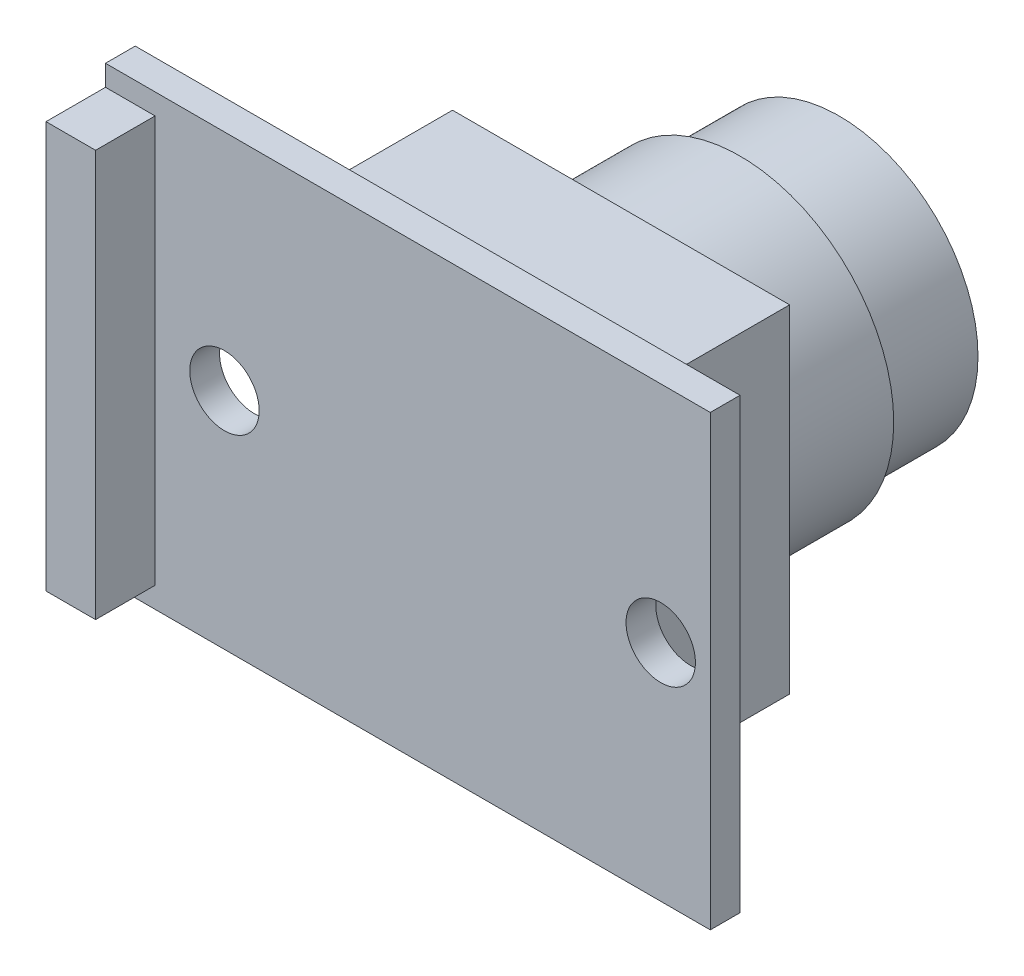
ISO-10303-21;
HEADER;
FILE_DESCRIPTION(('STEP AP214'),'2;1');
FILE_NAME('part.step','',(''),(''),'','','');
FILE_SCHEMA(('AUTOMOTIVE_DESIGN { 1 0 10303 214 1 1 1 1 }'));
ENDSEC;
DATA;
#1=APPLICATION_CONTEXT('core data for automotive mechanical design processes');
#2=APPLICATION_PROTOCOL_DEFINITION('international standard','automotive_design',2000,#1);
#3=PRODUCT_CONTEXT('',#1,'mechanical');
#4=PRODUCT('Part','Part','',(#3));
#5=PRODUCT_RELATED_PRODUCT_CATEGORY('part','',(#4));
#6=PRODUCT_DEFINITION_FORMATION('','',#4);
#7=PRODUCT_DEFINITION_CONTEXT('part definition',#1,'design');
#8=PRODUCT_DEFINITION('design','',#6,#7);
#9=PRODUCT_DEFINITION_SHAPE('','',#8);
#10=(LENGTH_UNIT() NAMED_UNIT(*) SI_UNIT(.MILLI.,.METRE.));
#11=(NAMED_UNIT(*) PLANE_ANGLE_UNIT() SI_UNIT($,.RADIAN.));
#12=(NAMED_UNIT(*) SI_UNIT($,.STERADIAN.) SOLID_ANGLE_UNIT());
#13=UNCERTAINTY_MEASURE_WITH_UNIT(LENGTH_MEASURE(1.E-05),#10,'distance_accuracy_value','');
#14=(GEOMETRIC_REPRESENTATION_CONTEXT(3) GLOBAL_UNCERTAINTY_ASSIGNED_CONTEXT((#13)) GLOBAL_UNIT_ASSIGNED_CONTEXT((#10,
#11,#12)) REPRESENTATION_CONTEXT('',''));
#15=CARTESIAN_POINT('',(0.,0.,0.));
#16=DIRECTION('',(0.,0.,1.));
#17=DIRECTION('',(1.,0.,0.));
#18=AXIS2_PLACEMENT_3D('',#15,#16,#17);
#19=CARTESIAN_POINT('',(0.,0.,5.));
#20=DIRECTION('',(0.,0.,-1.));
#21=DIRECTION('',(-1.,0.,0.));
#22=AXIS2_PLACEMENT_3D('',#19,#20,#21);
#23=CYLINDRICAL_SURFACE('',#22,7.);
#24=CARTESIAN_POINT('',(0.,0.,5.));
#25=DIRECTION('',(0.,0.,1.));
#26=DIRECTION('',(1.,0.,0.));
#27=AXIS2_PLACEMENT_3D('',#24,#25,#26);
#28=CIRCLE('',#27,7.);
#29=CARTESIAN_POINT('',(7.,0.,5.));
#30=VERTEX_POINT('',#29);
#31=EDGE_CURVE('E11',#30,#30,#28,.T.);
#32=ORIENTED_EDGE('',*,*,#31,.F.);
#33=EDGE_LOOP('',(#32));
#34=FACE_BOUND('',#33,.T.);
#35=CARTESIAN_POINT('',(0.,0.,0.));
#36=DIRECTION('',(0.,0.,1.));
#37=DIRECTION('',(1.,0.,0.));
#38=AXIS2_PLACEMENT_3D('',#35,#36,#37);
#39=CIRCLE('',#38,7.);
#40=CARTESIAN_POINT('',(7.,0.,0.));
#41=VERTEX_POINT('',#40);
#42=EDGE_CURVE('E42',#41,#41,#39,.T.);
#43=ORIENTED_EDGE('',*,*,#42,.T.);
#44=EDGE_LOOP('',(#43));
#45=FACE_BOUND('',#44,.T.);
#46=ADVANCED_FACE('F39',(#34,#45),#23,.T.);
#47=CARTESIAN_POINT('',(0.,0.,0.));
#48=DIRECTION('',(0.,0.,1.));
#49=DIRECTION('',(1.,0.,0.));
#50=AXIS2_PLACEMENT_3D('',#47,#48,#49);
#51=PLANE('',#50);
#52=ORIENTED_EDGE('',*,*,#42,.F.);
#53=EDGE_LOOP('',(#52));
#54=FACE_BOUND('',#53,.T.);
#55=ADVANCED_FACE('F284',(#54),#51,.F.);
#56=CARTESIAN_POINT('',(0.,0.,11.));
#57=DIRECTION('',(0.,0.,-1.));
#58=DIRECTION('',(-1.,0.,0.));
#59=AXIS2_PLACEMENT_3D('',#56,#57,#58);
#60=CYLINDRICAL_SURFACE('',#59,7.75);
#61=CARTESIAN_POINT('',(0.,0.,11.));
#62=DIRECTION('',(0.,0.,1.));
#63=DIRECTION('',(1.,0.,0.));
#64=AXIS2_PLACEMENT_3D('',#61,#62,#63);
#65=CIRCLE('',#64,7.75);
#66=CARTESIAN_POINT('',(7.75,0.,11.));
#67=VERTEX_POINT('',#66);
#68=EDGE_CURVE('E262',#67,#67,#65,.T.);
#69=ORIENTED_EDGE('',*,*,#68,.F.);
#70=EDGE_LOOP('',(#69));
#71=FACE_BOUND('',#70,.T.);
#72=CARTESIAN_POINT('',(0.,0.,5.));
#73=DIRECTION('',(0.,0.,1.));
#74=DIRECTION('',(1.,0.,0.));
#75=AXIS2_PLACEMENT_3D('',#72,#73,#74);
#76=CIRCLE('',#75,7.75);
#77=CARTESIAN_POINT('',(7.75,0.,5.));
#78=VERTEX_POINT('',#77);
#79=EDGE_CURVE('E261',#78,#78,#76,.T.);
#80=ORIENTED_EDGE('',*,*,#79,.T.);
#81=EDGE_LOOP('',(#80));
#82=FACE_BOUND('',#81,.T.);
#83=ADVANCED_FACE('F270',(#71,#82),#60,.T.);
#84=CARTESIAN_POINT('',(0.,0.,5.));
#85=DIRECTION('',(0.,0.,1.));
#86=DIRECTION('',(1.,0.,0.));
#87=AXIS2_PLACEMENT_3D('',#84,#85,#86);
#88=PLANE('',#87);
#89=ORIENTED_EDGE('',*,*,#31,.T.);
#90=EDGE_LOOP('',(#89));
#91=FACE_BOUND('',#90,.T.);
#92=ORIENTED_EDGE('',*,*,#79,.F.);
#93=EDGE_LOOP('',(#92));
#94=FACE_BOUND('',#93,.T.);
#95=ADVANCED_FACE('F272',(#91,#94),#88,.F.);
#96=CARTESIAN_POINT('',(-8.5,8.5,19.));
#97=DIRECTION('',(1.,0.,0.));
#98=DIRECTION('',(0.,0.,-1.));
#99=AXIS2_PLACEMENT_3D('',#96,#97,#98);
#100=PLANE('',#99);
#101=DIRECTION('',(0.,-1.,0.));
#102=VECTOR('',#101,1.);
#103=CARTESIAN_POINT('',(-8.5,8.5,11.));
#104=LINE('',#103,#102);
#105=CARTESIAN_POINT('',(-8.5,8.5,11.));
#106=VERTEX_POINT('',#105);
#107=CARTESIAN_POINT('',(-8.5,-8.5,11.));
#108=VERTEX_POINT('',#107);
#109=EDGE_CURVE('E216',#106,#108,#104,.T.);
#110=ORIENTED_EDGE('',*,*,#109,.T.);
#111=DIRECTION('',(0.,0.,-1.));
#112=VECTOR('',#111,1.);
#113=CARTESIAN_POINT('',(-8.5,-8.5,19.));
#114=LINE('',#113,#112);
#115=CARTESIAN_POINT('',(-8.5,-8.5,19.));
#116=VERTEX_POINT('',#115);
#117=EDGE_CURVE('E257',#116,#108,#114,.T.);
#118=ORIENTED_EDGE('',*,*,#117,.F.);
#119=DIRECTION('',(0.,-1.,0.));
#120=VECTOR('',#119,1.);
#121=CARTESIAN_POINT('',(-8.5,8.5,19.));
#122=LINE('',#121,#120);
#123=CARTESIAN_POINT('',(-8.5,8.5,19.));
#124=VERTEX_POINT('',#123);
#125=EDGE_CURVE('E217',#124,#116,#122,.T.);
#126=ORIENTED_EDGE('',*,*,#125,.F.);
#127=DIRECTION('',(0.,0.,-1.));
#128=VECTOR('',#127,1.);
#129=CARTESIAN_POINT('',(-8.5,8.5,19.));
#130=LINE('',#129,#128);
#131=EDGE_CURVE('E234',#124,#106,#130,.T.);
#132=ORIENTED_EDGE('',*,*,#131,.T.);
#133=EDGE_LOOP('',(#110,#118,#126,#132));
#134=FACE_BOUND('',#133,.T.);
#135=ADVANCED_FACE('F274',(#134),#100,.F.);
#136=CARTESIAN_POINT('',(-8.5,-8.5,19.));
#137=DIRECTION('',(0.,1.,0.));
#138=DIRECTION('',(0.,0.,1.));
#139=AXIS2_PLACEMENT_3D('',#136,#137,#138);
#140=PLANE('',#139);
#141=DIRECTION('',(1.,0.,0.));
#142=VECTOR('',#141,1.);
#143=CARTESIAN_POINT('',(-8.5,-8.5,11.));
#144=LINE('',#143,#142);
#145=CARTESIAN_POINT('',(8.5,-8.5,11.));
#146=VERTEX_POINT('',#145);
#147=EDGE_CURVE('E238',#108,#146,#144,.T.);
#148=ORIENTED_EDGE('',*,*,#147,.T.);
#149=DIRECTION('',(0.,0.,-1.));
#150=VECTOR('',#149,1.);
#151=CARTESIAN_POINT('',(8.5,-8.5,19.));
#152=LINE('',#151,#150);
#153=CARTESIAN_POINT('',(8.5,-8.5,19.));
#154=VERTEX_POINT('',#153);
#155=EDGE_CURVE('E253',#154,#146,#152,.T.);
#156=ORIENTED_EDGE('',*,*,#155,.F.);
#157=DIRECTION('',(1.,0.,0.));
#158=VECTOR('',#157,1.);
#159=CARTESIAN_POINT('',(-8.5,-8.5,19.));
#160=LINE('',#159,#158);
#161=EDGE_CURVE('E221',#116,#154,#160,.T.);
#162=ORIENTED_EDGE('',*,*,#161,.F.);
#163=ORIENTED_EDGE('',*,*,#117,.T.);
#164=EDGE_LOOP('',(#148,#156,#162,#163));
#165=FACE_BOUND('',#164,.T.);
#166=ADVANCED_FACE('F281',(#165),#140,.F.);
#167=CARTESIAN_POINT('',(8.5,8.5,19.));
#168=DIRECTION('',(-1.,0.,0.));
#169=DIRECTION('',(0.,0.,1.));
#170=AXIS2_PLACEMENT_3D('',#167,#168,#169);
#171=PLANE('',#170);
#172=DIRECTION('',(0.,1.,0.));
#173=VECTOR('',#172,1.);
#174=CARTESIAN_POINT('',(8.5,8.5,11.));
#175=LINE('',#174,#173);
#176=CARTESIAN_POINT('',(8.5,8.5,11.));
#177=VERTEX_POINT('',#176);
#178=EDGE_CURVE('E241',#146,#177,#175,.T.);
#179=ORIENTED_EDGE('',*,*,#178,.T.);
#180=DIRECTION('',(0.,0.,-1.));
#181=VECTOR('',#180,1.);
#182=CARTESIAN_POINT('',(8.5,8.5,19.));
#183=LINE('',#182,#181);
#184=CARTESIAN_POINT('',(8.5,8.5,19.));
#185=VERTEX_POINT('',#184);
#186=EDGE_CURVE('E249',#185,#177,#183,.T.);
#187=ORIENTED_EDGE('',*,*,#186,.F.);
#188=DIRECTION('',(0.,1.,0.));
#189=VECTOR('',#188,1.);
#190=CARTESIAN_POINT('',(8.5,8.5,19.));
#191=LINE('',#190,#189);
#192=EDGE_CURVE('E226',#154,#185,#191,.T.);
#193=ORIENTED_EDGE('',*,*,#192,.F.);
#194=ORIENTED_EDGE('',*,*,#155,.T.);
#195=EDGE_LOOP('',(#179,#187,#193,#194));
#196=FACE_BOUND('',#195,.T.);
#197=ADVANCED_FACE('F339',(#196),#171,.F.);
#198=CARTESIAN_POINT('',(-8.5,8.5,19.));
#199=DIRECTION('',(0.,-1.,0.));
#200=DIRECTION('',(0.,0.,-1.));
#201=AXIS2_PLACEMENT_3D('',#198,#199,#200);
#202=PLANE('',#201);
#203=DIRECTION('',(-1.,0.,0.));
#204=VECTOR('',#203,1.);
#205=CARTESIAN_POINT('',(-8.5,8.5,11.));
#206=LINE('',#205,#204);
#207=EDGE_CURVE('E222',#177,#106,#206,.T.);
#208=ORIENTED_EDGE('',*,*,#207,.T.);
#209=ORIENTED_EDGE('',*,*,#131,.F.);
#210=DIRECTION('',(-1.,0.,0.));
#211=VECTOR('',#210,1.);
#212=CARTESIAN_POINT('',(-8.5,8.5,19.));
#213=LINE('',#212,#211);
#214=EDGE_CURVE('E230',#185,#124,#213,.T.);
#215=ORIENTED_EDGE('',*,*,#214,.F.);
#216=ORIENTED_EDGE('',*,*,#186,.T.);
#217=EDGE_LOOP('',(#208,#209,#215,#216));
#218=FACE_BOUND('',#217,.T.);
#219=ADVANCED_FACE('F320',(#218),#202,.F.);
#220=CARTESIAN_POINT('',(0.,0.,11.));
#221=DIRECTION('',(0.,0.,1.));
#222=DIRECTION('',(1.,0.,0.));
#223=AXIS2_PLACEMENT_3D('',#220,#221,#222);
#224=PLANE('',#223);
#225=ORIENTED_EDGE('',*,*,#68,.T.);
#226=EDGE_LOOP('',(#225));
#227=FACE_BOUND('',#226,.T.);
#228=ORIENTED_EDGE('',*,*,#109,.F.);
#229=ORIENTED_EDGE('',*,*,#207,.F.);
#230=ORIENTED_EDGE('',*,*,#178,.F.);
#231=ORIENTED_EDGE('',*,*,#147,.F.);
#232=EDGE_LOOP('',(#228,#229,#230,#231));
#233=FACE_BOUND('',#232,.T.);
#234=ADVANCED_FACE('F314',(#227,#233),#224,.F.);
#235=CARTESIAN_POINT('',(0.,0.,19.));
#236=DIRECTION('',(0.,0.,1.));
#237=DIRECTION('',(1.,0.,0.));
#238=AXIS2_PLACEMENT_3D('',#235,#236,#237);
#239=PLANE('',#238);
#240=DIRECTION('',(0.,-1.,0.));
#241=VECTOR('',#240,1.);
#242=CARTESIAN_POINT('',(-16.5,11.3,19.));
#243=LINE('',#242,#241);
#244=CARTESIAN_POINT('',(-16.5,11.3,19.));
#245=VERTEX_POINT('',#244);
#246=CARTESIAN_POINT('',(-16.5,-11.3,19.));
#247=VERTEX_POINT('',#246);
#248=EDGE_CURVE('E173',#245,#247,#243,.T.);
#249=ORIENTED_EDGE('',*,*,#248,.F.);
#250=DIRECTION('',(-1.,0.,0.));
#251=VECTOR('',#250,1.);
#252=CARTESIAN_POINT('',(-16.5,11.3,19.));
#253=LINE('',#252,#251);
#254=CARTESIAN_POINT('',(14.,11.3,19.));
#255=VERTEX_POINT('',#254);
#256=EDGE_CURVE('E198',#255,#245,#253,.T.);
#257=ORIENTED_EDGE('',*,*,#256,.F.);
#258=DIRECTION('',(0.,1.,0.));
#259=VECTOR('',#258,1.);
#260=CARTESIAN_POINT('',(14.,11.3,19.));
#261=LINE('',#260,#259);
#262=CARTESIAN_POINT('',(14.,-11.3,19.));
#263=VERTEX_POINT('',#262);
#264=EDGE_CURVE('E195',#263,#255,#261,.T.);
#265=ORIENTED_EDGE('',*,*,#264,.F.);
#266=DIRECTION('',(1.,0.,0.));
#267=VECTOR('',#266,1.);
#268=CARTESIAN_POINT('',(-16.5,-11.3,19.));
#269=LINE('',#268,#267);
#270=EDGE_CURVE('E192',#247,#263,#269,.T.);
#271=ORIENTED_EDGE('',*,*,#270,.F.);
#272=EDGE_LOOP('',(#249,#257,#265,#271));
#273=FACE_BOUND('',#272,.T.);
#274=CARTESIAN_POINT('',(11.5,0.,19.));
#275=DIRECTION('',(0.,0.,1.));
#276=DIRECTION('',(1.,0.,0.));
#277=AXIS2_PLACEMENT_3D('',#274,#275,#276);
#278=CIRCLE('',#277,1.75);
#279=CARTESIAN_POINT('',(13.25,0.,19.));
#280=VERTEX_POINT('',#279);
#281=EDGE_CURVE('E167',#280,#280,#278,.T.);
#282=ORIENTED_EDGE('',*,*,#281,.T.);
#283=EDGE_LOOP('',(#282));
#284=FACE_BOUND('',#283,.T.);
#285=CARTESIAN_POINT('',(-10.5,0.,19.));
#286=DIRECTION('',(0.,0.,1.));
#287=DIRECTION('',(1.,0.,0.));
#288=AXIS2_PLACEMENT_3D('',#285,#286,#287);
#289=CIRCLE('',#288,1.75);
#290=CARTESIAN_POINT('',(-8.75,0.,19.));
#291=VERTEX_POINT('',#290);
#292=EDGE_CURVE('E154',#291,#291,#289,.T.);
#293=ORIENTED_EDGE('',*,*,#292,.T.);
#294=EDGE_LOOP('',(#293));
#295=FACE_BOUND('',#294,.T.);
#296=ORIENTED_EDGE('',*,*,#214,.T.);
#297=ORIENTED_EDGE('',*,*,#125,.T.);
#298=ORIENTED_EDGE('',*,*,#161,.T.);
#299=ORIENTED_EDGE('',*,*,#192,.T.);
#300=EDGE_LOOP('',(#296,#297,#298,#299));
#301=FACE_BOUND('',#300,.T.);
#302=ADVANCED_FACE('F319',(#273,#284,#295,#301),#239,.F.);
#303=CARTESIAN_POINT('',(0.,0.,20.5));
#304=DIRECTION('',(0.,0.,1.));
#305=DIRECTION('',(1.,0.,0.));
#306=AXIS2_PLACEMENT_3D('',#303,#304,#305);
#307=PLANE('',#306);
#308=DIRECTION('',(-1.,0.,0.));
#309=VECTOR('',#308,1.);
#310=CARTESIAN_POINT('',(-16.5,10.25,20.5));
#311=LINE('',#310,#309);
#312=CARTESIAN_POINT('',(-14.,10.25,20.5));
#313=VERTEX_POINT('',#312);
#314=CARTESIAN_POINT('',(-16.5,10.25,20.5));
#315=VERTEX_POINT('',#314);
#316=EDGE_CURVE('E54',#313,#315,#311,.T.);
#317=ORIENTED_EDGE('',*,*,#316,.F.);
#318=DIRECTION('',(0.,1.,0.));
#319=VECTOR('',#318,1.);
#320=CARTESIAN_POINT('',(-14.,10.25,20.5));
#321=LINE('',#320,#319);
#322=CARTESIAN_POINT('',(-14.,-10.25,20.5));
#323=VERTEX_POINT('',#322);
#324=EDGE_CURVE('E475',#323,#313,#321,.T.);
#325=ORIENTED_EDGE('',*,*,#324,.F.);
#326=DIRECTION('',(1.,0.,0.));
#327=VECTOR('',#326,1.);
#328=CARTESIAN_POINT('',(-16.5,-10.25,20.5));
#329=LINE('',#328,#327);
#330=CARTESIAN_POINT('',(-16.5,-10.25,20.5));
#331=VERTEX_POINT('',#330);
#332=EDGE_CURVE('E60',#331,#323,#329,.T.);
#333=ORIENTED_EDGE('',*,*,#332,.F.);
#334=DIRECTION('',(0.,-1.,0.));
#335=VECTOR('',#334,1.);
#336=CARTESIAN_POINT('',(-16.5,11.3,20.5));
#337=LINE('',#336,#335);
#338=CARTESIAN_POINT('',(-16.5,-11.3,20.5));
#339=VERTEX_POINT('',#338);
#340=EDGE_CURVE('E152',#331,#339,#337,.T.);
#341=ORIENTED_EDGE('',*,*,#340,.T.);
#342=DIRECTION('',(1.,0.,0.));
#343=VECTOR('',#342,1.);
#344=CARTESIAN_POINT('',(-16.5,-11.3,20.5));
#345=LINE('',#344,#343);
#346=CARTESIAN_POINT('',(14.,-11.3,20.5));
#347=VERTEX_POINT('',#346);
#348=EDGE_CURVE('E180',#339,#347,#345,.T.);
#349=ORIENTED_EDGE('',*,*,#348,.T.);
#350=DIRECTION('',(0.,1.,0.));
#351=VECTOR('',#350,1.);
#352=CARTESIAN_POINT('',(14.,11.3,20.5));
#353=LINE('',#352,#351);
#354=CARTESIAN_POINT('',(14.,11.3,20.5));
#355=VERTEX_POINT('',#354);
#356=EDGE_CURVE('E183',#347,#355,#353,.T.);
#357=ORIENTED_EDGE('',*,*,#356,.T.);
#358=DIRECTION('',(-1.,0.,0.));
#359=VECTOR('',#358,1.);
#360=CARTESIAN_POINT('',(-16.5,11.3,20.5));
#361=LINE('',#360,#359);
#362=CARTESIAN_POINT('',(-16.5,11.3,20.5));
#363=VERTEX_POINT('',#362);
#364=EDGE_CURVE('E186',#355,#363,#361,.T.);
#365=ORIENTED_EDGE('',*,*,#364,.T.);
#366=EDGE_CURVE('E177',#363,#315,#337,.T.);
#367=ORIENTED_EDGE('',*,*,#366,.T.);
#368=EDGE_LOOP('',(#317,#325,#333,#341,#349,#357,#365,#367));
#369=FACE_BOUND('',#368,.T.);
#370=CARTESIAN_POINT('',(11.5,0.,20.5));
#371=DIRECTION('',(0.,0.,1.));
#372=DIRECTION('',(1.,0.,0.));
#373=AXIS2_PLACEMENT_3D('',#370,#371,#372);
#374=CIRCLE('',#373,1.75);
#375=CARTESIAN_POINT('',(13.25,0.,20.5));
#376=VERTEX_POINT('',#375);
#377=EDGE_CURVE('E169',#376,#376,#374,.T.);
#378=ORIENTED_EDGE('',*,*,#377,.F.);
#379=EDGE_LOOP('',(#378));
#380=FACE_BOUND('',#379,.T.);
#381=CARTESIAN_POINT('',(-10.5,0.,20.5));
#382=DIRECTION('',(0.,0.,1.));
#383=DIRECTION('',(1.,0.,0.));
#384=AXIS2_PLACEMENT_3D('',#381,#382,#383);
#385=CIRCLE('',#384,1.75);
#386=CARTESIAN_POINT('',(-8.75,0.,20.5));
#387=VERTEX_POINT('',#386);
#388=EDGE_CURVE('E159',#387,#387,#385,.T.);
#389=ORIENTED_EDGE('',*,*,#388,.F.);
#390=EDGE_LOOP('',(#389));
#391=FACE_BOUND('',#390,.T.);
#392=ADVANCED_FACE('F363',(#369,#380,#391),#307,.T.);
#393=CARTESIAN_POINT('',(-16.5,11.3,20.5));
#394=DIRECTION('',(1.,0.,0.));
#395=DIRECTION('',(0.,1.,0.));
#396=AXIS2_PLACEMENT_3D('',#393,#394,#395);
#397=PLANE('',#396);
#398=ORIENTED_EDGE('',*,*,#248,.T.);
#399=DIRECTION('',(0.,0.,-1.));
#400=VECTOR('',#399,1.);
#401=CARTESIAN_POINT('',(-16.5,-11.3,20.5));
#402=LINE('',#401,#400);
#403=EDGE_CURVE('E212',#339,#247,#402,.T.);
#404=ORIENTED_EDGE('',*,*,#403,.F.);
#405=ORIENTED_EDGE('',*,*,#340,.F.);
#406=DIRECTION('',(0.,0.,-1.));
#407=VECTOR('',#406,1.);
#408=CARTESIAN_POINT('',(-16.5,-10.25,23.5));
#409=LINE('',#408,#407);
#410=CARTESIAN_POINT('',(-16.5,-10.25,23.5));
#411=VERTEX_POINT('',#410);
#412=EDGE_CURVE('E131',#411,#331,#409,.T.);
#413=ORIENTED_EDGE('',*,*,#412,.F.);
#414=DIRECTION('',(0.,-1.,0.));
#415=VECTOR('',#414,1.);
#416=CARTESIAN_POINT('',(-16.5,10.25,23.5));
#417=LINE('',#416,#415);
#418=CARTESIAN_POINT('',(-16.5,10.25,23.5));
#419=VERTEX_POINT('',#418);
#420=EDGE_CURVE('E138',#419,#411,#417,.T.);
#421=ORIENTED_EDGE('',*,*,#420,.F.);
#422=DIRECTION('',(0.,0.,-1.));
#423=VECTOR('',#422,1.);
#424=CARTESIAN_POINT('',(-16.5,10.25,23.5));
#425=LINE('',#424,#423);
#426=EDGE_CURVE('E472',#419,#315,#425,.T.);
#427=ORIENTED_EDGE('',*,*,#426,.T.);
#428=ORIENTED_EDGE('',*,*,#366,.F.);
#429=DIRECTION('',(0.,0.,-1.));
#430=VECTOR('',#429,1.);
#431=CARTESIAN_POINT('',(-16.5,11.3,20.5));
#432=LINE('',#431,#430);
#433=EDGE_CURVE('E189',#363,#245,#432,.T.);
#434=ORIENTED_EDGE('',*,*,#433,.T.);
#435=EDGE_LOOP('',(#398,#404,#405,#413,#421,#427,#428,#434));
#436=FACE_BOUND('',#435,.T.);
#437=ADVANCED_FACE('F150',(#436),#397,.F.);
#438=CARTESIAN_POINT('',(-16.5,-11.3,20.5));
#439=DIRECTION('',(0.,1.,0.));
#440=DIRECTION('',(0.,0.,1.));
#441=AXIS2_PLACEMENT_3D('',#438,#439,#440);
#442=PLANE('',#441);
#443=ORIENTED_EDGE('',*,*,#270,.T.);
#444=DIRECTION('',(0.,0.,-1.));
#445=VECTOR('',#444,1.);
#446=CARTESIAN_POINT('',(14.,-11.3,20.5));
#447=LINE('',#446,#445);
#448=EDGE_CURVE('E208',#347,#263,#447,.T.);
#449=ORIENTED_EDGE('',*,*,#448,.F.);
#450=ORIENTED_EDGE('',*,*,#348,.F.);
#451=ORIENTED_EDGE('',*,*,#403,.T.);
#452=EDGE_LOOP('',(#443,#449,#450,#451));
#453=FACE_BOUND('',#452,.T.);
#454=ADVANCED_FACE('F371',(#453),#442,.F.);
#455=CARTESIAN_POINT('',(14.,11.3,20.5));
#456=DIRECTION('',(-1.,0.,0.));
#457=DIRECTION('',(0.,-1.,0.));
#458=AXIS2_PLACEMENT_3D('',#455,#456,#457);
#459=PLANE('',#458);
#460=ORIENTED_EDGE('',*,*,#264,.T.);
#461=DIRECTION('',(0.,0.,-1.));
#462=VECTOR('',#461,1.);
#463=CARTESIAN_POINT('',(14.,11.3,20.5));
#464=LINE('',#463,#462);
#465=EDGE_CURVE('E204',#355,#255,#464,.T.);
#466=ORIENTED_EDGE('',*,*,#465,.F.);
#467=ORIENTED_EDGE('',*,*,#356,.F.);
#468=ORIENTED_EDGE('',*,*,#448,.T.);
#469=EDGE_LOOP('',(#460,#466,#467,#468));
#470=FACE_BOUND('',#469,.T.);
#471=ADVANCED_FACE('F376',(#470),#459,.F.);
#472=CARTESIAN_POINT('',(-16.5,11.3,20.5));
#473=DIRECTION('',(0.,-1.,0.));
#474=DIRECTION('',(0.,0.,-1.));
#475=AXIS2_PLACEMENT_3D('',#472,#473,#474);
#476=PLANE('',#475);
#477=ORIENTED_EDGE('',*,*,#256,.T.);
#478=ORIENTED_EDGE('',*,*,#433,.F.);
#479=ORIENTED_EDGE('',*,*,#364,.F.);
#480=ORIENTED_EDGE('',*,*,#465,.T.);
#481=EDGE_LOOP('',(#477,#478,#479,#480));
#482=FACE_BOUND('',#481,.T.);
#483=ADVANCED_FACE('F388',(#482),#476,.F.);
#484=CARTESIAN_POINT('',(11.5,0.,20.5));
#485=DIRECTION('',(0.,0.,-1.));
#486=DIRECTION('',(-1.,0.,0.));
#487=AXIS2_PLACEMENT_3D('',#484,#485,#486);
#488=CYLINDRICAL_SURFACE('',#487,1.75);
#489=ORIENTED_EDGE('',*,*,#377,.T.);
#490=EDGE_LOOP('',(#489));
#491=FACE_BOUND('',#490,.T.);
#492=ORIENTED_EDGE('',*,*,#281,.F.);
#493=EDGE_LOOP('',(#492));
#494=FACE_BOUND('',#493,.T.);
#495=ADVANCED_FACE('F398',(#491,#494),#488,.F.);
#496=CARTESIAN_POINT('',(-10.5,0.,20.5));
#497=DIRECTION('',(0.,0.,-1.));
#498=DIRECTION('',(-1.,0.,0.));
#499=AXIS2_PLACEMENT_3D('',#496,#497,#498);
#500=CYLINDRICAL_SURFACE('',#499,1.75);
#501=ORIENTED_EDGE('',*,*,#388,.T.);
#502=EDGE_LOOP('',(#501));
#503=FACE_BOUND('',#502,.T.);
#504=ORIENTED_EDGE('',*,*,#292,.F.);
#505=EDGE_LOOP('',(#504));
#506=FACE_BOUND('',#505,.T.);
#507=ADVANCED_FACE('F408',(#503,#506),#500,.F.);
#508=CARTESIAN_POINT('',(-16.5,-10.25,23.5));
#509=DIRECTION('',(0.,1.,0.));
#510=DIRECTION('',(0.,0.,1.));
#511=AXIS2_PLACEMENT_3D('',#508,#509,#510);
#512=PLANE('',#511);
#513=ORIENTED_EDGE('',*,*,#332,.T.);
#514=DIRECTION('',(0.,0.,-1.));
#515=VECTOR('',#514,1.);
#516=CARTESIAN_POINT('',(-14.,-10.25,23.5));
#517=LINE('',#516,#515);
#518=CARTESIAN_POINT('',(-14.,-10.25,23.5));
#519=VERTEX_POINT('',#518);
#520=EDGE_CURVE('E133',#519,#323,#517,.T.);
#521=ORIENTED_EDGE('',*,*,#520,.F.);
#522=DIRECTION('',(1.,0.,0.));
#523=VECTOR('',#522,1.);
#524=CARTESIAN_POINT('',(-16.5,-10.25,23.5));
#525=LINE('',#524,#523);
#526=EDGE_CURVE('E127',#411,#519,#525,.T.);
#527=ORIENTED_EDGE('',*,*,#526,.F.);
#528=ORIENTED_EDGE('',*,*,#412,.T.);
#529=EDGE_LOOP('',(#513,#521,#527,#528));
#530=FACE_BOUND('',#529,.T.);
#531=ADVANCED_FACE('F129',(#530),#512,.F.);
#532=CARTESIAN_POINT('',(-14.,10.25,23.5));
#533=DIRECTION('',(-1.,0.,0.));
#534=DIRECTION('',(0.,-1.,0.));
#535=AXIS2_PLACEMENT_3D('',#532,#533,#534);
#536=PLANE('',#535);
#537=ORIENTED_EDGE('',*,*,#324,.T.);
#538=DIRECTION('',(0.,0.,-1.));
#539=VECTOR('',#538,1.);
#540=CARTESIAN_POINT('',(-14.,10.25,23.5));
#541=LINE('',#540,#539);
#542=CARTESIAN_POINT('',(-14.,10.25,23.5));
#543=VERTEX_POINT('',#542);
#544=EDGE_CURVE('E161',#543,#313,#541,.T.);
#545=ORIENTED_EDGE('',*,*,#544,.F.);
#546=DIRECTION('',(0.,1.,0.));
#547=VECTOR('',#546,1.);
#548=CARTESIAN_POINT('',(-14.,10.25,23.5));
#549=LINE('',#548,#547);
#550=EDGE_CURVE('E137',#519,#543,#549,.T.);
#551=ORIENTED_EDGE('',*,*,#550,.F.);
#552=ORIENTED_EDGE('',*,*,#520,.T.);
#553=EDGE_LOOP('',(#537,#545,#551,#552));
#554=FACE_BOUND('',#553,.T.);
#555=ADVANCED_FACE('F440',(#554),#536,.F.);
#556=CARTESIAN_POINT('',(-16.5,10.25,23.5));
#557=DIRECTION('',(0.,-1.,0.));
#558=DIRECTION('',(1.,0.,0.));
#559=AXIS2_PLACEMENT_3D('',#556,#557,#558);
#560=PLANE('',#559);
#561=ORIENTED_EDGE('',*,*,#316,.T.);
#562=ORIENTED_EDGE('',*,*,#426,.F.);
#563=DIRECTION('',(-1.,0.,0.));
#564=VECTOR('',#563,1.);
#565=CARTESIAN_POINT('',(-16.5,10.25,23.5));
#566=LINE('',#565,#564);
#567=EDGE_CURVE('E143',#543,#419,#566,.T.);
#568=ORIENTED_EDGE('',*,*,#567,.F.);
#569=ORIENTED_EDGE('',*,*,#544,.T.);
#570=EDGE_LOOP('',(#561,#562,#568,#569));
#571=FACE_BOUND('',#570,.T.);
#572=ADVANCED_FACE('F449',(#571),#560,.F.);
#573=CARTESIAN_POINT('',(0.,0.,23.5));
#574=DIRECTION('',(0.,0.,1.));
#575=DIRECTION('',(1.,0.,0.));
#576=AXIS2_PLACEMENT_3D('',#573,#574,#575);
#577=PLANE('',#576);
#578=ORIENTED_EDGE('',*,*,#420,.T.);
#579=ORIENTED_EDGE('',*,*,#526,.T.);
#580=ORIENTED_EDGE('',*,*,#550,.T.);
#581=ORIENTED_EDGE('',*,*,#567,.T.);
#582=EDGE_LOOP('',(#578,#579,#580,#581));
#583=FACE_BOUND('',#582,.T.);
#584=ADVANCED_FACE('F141',(#583),#577,.T.);
#585=CLOSED_SHELL('',(#46,#55,#83,#95,#135,#166,#197,#219,#234,#302,#392,#437,#454,#471,#483,
#495,#507,#531,#555,#572,#584));
#586=MANIFOLD_SOLID_BREP('B2',#585);
#587=ADVANCED_BREP_SHAPE_REPRESENTATION('',(#18,#586),#14);
#588=SHAPE_DEFINITION_REPRESENTATION(#9,#587);
ENDSEC;
END-ISO-10303-21;
